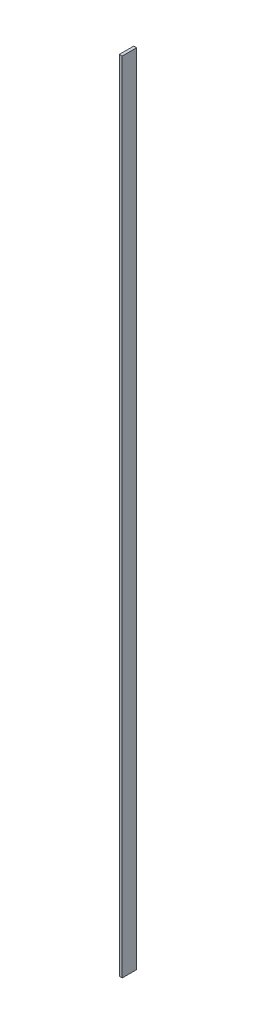
ISO-10303-21;
HEADER;
FILE_DESCRIPTION(('STEP AP214'),'2;1');
FILE_NAME('part.step','',(''),(''),'','','');
FILE_SCHEMA(('AUTOMOTIVE_DESIGN { 1 0 10303 214 1 1 1 1 }'));
ENDSEC;
DATA;
#1=APPLICATION_CONTEXT('core data for automotive mechanical design processes');
#2=APPLICATION_PROTOCOL_DEFINITION('international standard','automotive_design',2000,#1);
#3=PRODUCT_CONTEXT('',#1,'mechanical');
#4=PRODUCT('Part','Part','',(#3));
#5=PRODUCT_RELATED_PRODUCT_CATEGORY('part','',(#4));
#6=PRODUCT_DEFINITION_FORMATION('','',#4);
#7=PRODUCT_DEFINITION_CONTEXT('part definition',#1,'design');
#8=PRODUCT_DEFINITION('design','',#6,#7);
#9=PRODUCT_DEFINITION_SHAPE('','',#8);
#10=(LENGTH_UNIT() NAMED_UNIT(*) SI_UNIT(.MILLI.,.METRE.));
#11=(NAMED_UNIT(*) PLANE_ANGLE_UNIT() SI_UNIT($,.RADIAN.));
#12=(NAMED_UNIT(*) SI_UNIT($,.STERADIAN.) SOLID_ANGLE_UNIT());
#13=UNCERTAINTY_MEASURE_WITH_UNIT(LENGTH_MEASURE(1.E-05),#10,'distance_accuracy_value','');
#14=(GEOMETRIC_REPRESENTATION_CONTEXT(3) GLOBAL_UNCERTAINTY_ASSIGNED_CONTEXT((#13)) GLOBAL_UNIT_ASSIGNED_CONTEXT((#10,
#11,#12)) REPRESENTATION_CONTEXT('',''));
#15=CARTESIAN_POINT('',(0.,0.,0.));
#16=DIRECTION('',(0.,0.,1.));
#17=DIRECTION('',(1.,0.,0.));
#18=AXIS2_PLACEMENT_3D('',#15,#16,#17);
#19=CARTESIAN_POINT('',(2.,1100.,-10.));
#20=DIRECTION('',(-1.,0.,0.));
#21=DIRECTION('',(0.,0.,1.));
#22=AXIS2_PLACEMENT_3D('',#19,#20,#21);
#23=PLANE('',#22);
#24=DIRECTION('',(0.,0.,-1.));
#25=VECTOR('',#24,1.);
#26=CARTESIAN_POINT('',(2.,0.,-10.));
#27=LINE('',#26,#25);
#28=CARTESIAN_POINT('',(2.,0.,9.99999999999999));
#29=VERTEX_POINT('',#28);
#30=CARTESIAN_POINT('',(2.,0.,-10.));
#31=VERTEX_POINT('',#30);
#32=EDGE_CURVE('E97',#29,#31,#27,.T.);
#33=ORIENTED_EDGE('',*,*,#32,.T.);
#34=DIRECTION('',(0.,-1.,0.));
#35=VECTOR('',#34,1.);
#36=CARTESIAN_POINT('',(2.,1100.,-10.));
#37=LINE('',#36,#35);
#38=CARTESIAN_POINT('',(2.,1100.,-10.));
#39=VERTEX_POINT('',#38);
#40=EDGE_CURVE('E11',#39,#31,#37,.T.);
#41=ORIENTED_EDGE('',*,*,#40,.F.);
#42=DIRECTION('',(0.,0.,-1.));
#43=VECTOR('',#42,1.);
#44=CARTESIAN_POINT('',(2.,1100.,-10.));
#45=LINE('',#44,#43);
#46=CARTESIAN_POINT('',(2.,1100.,9.99999999999999));
#47=VERTEX_POINT('',#46);
#48=EDGE_CURVE('E85',#47,#39,#45,.T.);
#49=ORIENTED_EDGE('',*,*,#48,.F.);
#50=DIRECTION('',(0.,-1.,0.));
#51=VECTOR('',#50,1.);
#52=CARTESIAN_POINT('',(2.,1100.,9.99999999999999));
#53=LINE('',#52,#51);
#54=EDGE_CURVE('E93',#47,#29,#53,.T.);
#55=ORIENTED_EDGE('',*,*,#54,.T.);
#56=EDGE_LOOP('',(#33,#41,#49,#55));
#57=FACE_BOUND('',#56,.T.);
#58=ADVANCED_FACE('F34',(#57),#23,.F.);
#59=CARTESIAN_POINT('',(-2.,1100.,-10.));
#60=DIRECTION('',(0.,0.,1.));
#61=DIRECTION('',(1.,0.,0.));
#62=AXIS2_PLACEMENT_3D('',#59,#60,#61);
#63=PLANE('',#62);
#64=DIRECTION('',(-1.,0.,0.));
#65=VECTOR('',#64,1.);
#66=CARTESIAN_POINT('',(-2.,0.,-10.));
#67=LINE('',#66,#65);
#68=CARTESIAN_POINT('',(-2.,0.,-10.));
#69=VERTEX_POINT('',#68);
#70=EDGE_CURVE('E89',#31,#69,#67,.T.);
#71=ORIENTED_EDGE('',*,*,#70,.T.);
#72=DIRECTION('',(0.,-1.,0.));
#73=VECTOR('',#72,1.);
#74=CARTESIAN_POINT('',(-2.,1100.,-10.));
#75=LINE('',#74,#73);
#76=CARTESIAN_POINT('',(-2.,1100.,-10.));
#77=VERTEX_POINT('',#76);
#78=EDGE_CURVE('E42',#77,#69,#75,.T.);
#79=ORIENTED_EDGE('',*,*,#78,.F.);
#80=DIRECTION('',(-1.,0.,0.));
#81=VECTOR('',#80,1.);
#82=CARTESIAN_POINT('',(-2.,1100.,-10.));
#83=LINE('',#82,#81);
#84=EDGE_CURVE('E80',#39,#77,#83,.T.);
#85=ORIENTED_EDGE('',*,*,#84,.F.);
#86=ORIENTED_EDGE('',*,*,#40,.T.);
#87=EDGE_LOOP('',(#71,#79,#85,#86));
#88=FACE_BOUND('',#87,.T.);
#89=ADVANCED_FACE('F88',(#88),#63,.F.);
#90=CARTESIAN_POINT('',(-2.,1100.,-10.));
#91=DIRECTION('',(1.,0.,0.));
#92=DIRECTION('',(0.,0.,-1.));
#93=AXIS2_PLACEMENT_3D('',#90,#91,#92);
#94=PLANE('',#93);
#95=DIRECTION('',(0.,0.,1.));
#96=VECTOR('',#95,1.);
#97=CARTESIAN_POINT('',(-2.,0.,-10.));
#98=LINE('',#97,#96);
#99=CARTESIAN_POINT('',(-2.,0.,9.99999999999999));
#100=VERTEX_POINT('',#99);
#101=EDGE_CURVE('E67',#69,#100,#98,.T.);
#102=ORIENTED_EDGE('',*,*,#101,.T.);
#103=DIRECTION('',(0.,-1.,0.));
#104=VECTOR('',#103,1.);
#105=CARTESIAN_POINT('',(-2.,1100.,9.99999999999999));
#106=LINE('',#105,#104);
#107=CARTESIAN_POINT('',(-2.,1100.,9.99999999999999));
#108=VERTEX_POINT('',#107);
#109=EDGE_CURVE('E90',#108,#100,#106,.T.);
#110=ORIENTED_EDGE('',*,*,#109,.F.);
#111=DIRECTION('',(0.,0.,1.));
#112=VECTOR('',#111,1.);
#113=CARTESIAN_POINT('',(-2.,1100.,-10.));
#114=LINE('',#113,#112);
#115=EDGE_CURVE('E83',#77,#108,#114,.T.);
#116=ORIENTED_EDGE('',*,*,#115,.F.);
#117=ORIENTED_EDGE('',*,*,#78,.T.);
#118=EDGE_LOOP('',(#102,#110,#116,#117));
#119=FACE_BOUND('',#118,.T.);
#120=ADVANCED_FACE('F91',(#119),#94,.F.);
#121=CARTESIAN_POINT('',(-2.,1100.,9.99999999999999));
#122=DIRECTION('',(0.,0.,-1.));
#123=DIRECTION('',(-1.,0.,0.));
#124=AXIS2_PLACEMENT_3D('',#121,#122,#123);
#125=PLANE('',#124);
#126=DIRECTION('',(1.,0.,0.));
#127=VECTOR('',#126,1.);
#128=CARTESIAN_POINT('',(-2.,0.,9.99999999999999));
#129=LINE('',#128,#127);
#130=EDGE_CURVE('E73',#100,#29,#129,.T.);
#131=ORIENTED_EDGE('',*,*,#130,.T.);
#132=ORIENTED_EDGE('',*,*,#54,.F.);
#133=DIRECTION('',(1.,0.,0.));
#134=VECTOR('',#133,1.);
#135=CARTESIAN_POINT('',(-2.,1100.,9.99999999999999));
#136=LINE('',#135,#134);
#137=EDGE_CURVE('E50',#108,#47,#136,.T.);
#138=ORIENTED_EDGE('',*,*,#137,.F.);
#139=ORIENTED_EDGE('',*,*,#109,.T.);
#140=EDGE_LOOP('',(#131,#132,#138,#139));
#141=FACE_BOUND('',#140,.T.);
#142=ADVANCED_FACE('F104',(#141),#125,.F.);
#143=CARTESIAN_POINT('',(0.,1100.,0.));
#144=DIRECTION('',(0.,1.,0.));
#145=DIRECTION('',(0.,0.,1.));
#146=AXIS2_PLACEMENT_3D('',#143,#144,#145);
#147=PLANE('',#146);
#148=ORIENTED_EDGE('',*,*,#48,.T.);
#149=ORIENTED_EDGE('',*,*,#84,.T.);
#150=ORIENTED_EDGE('',*,*,#115,.T.);
#151=ORIENTED_EDGE('',*,*,#137,.T.);
#152=EDGE_LOOP('',(#148,#149,#150,#151));
#153=FACE_BOUND('',#152,.T.);
#154=ADVANCED_FACE('F81',(#153),#147,.T.);
#155=CARTESIAN_POINT('',(0.,0.,0.));
#156=DIRECTION('',(0.,1.,0.));
#157=DIRECTION('',(0.,0.,1.));
#158=AXIS2_PLACEMENT_3D('',#155,#156,#157);
#159=PLANE('',#158);
#160=ORIENTED_EDGE('',*,*,#32,.F.);
#161=ORIENTED_EDGE('',*,*,#130,.F.);
#162=ORIENTED_EDGE('',*,*,#101,.F.);
#163=ORIENTED_EDGE('',*,*,#70,.F.);
#164=EDGE_LOOP('',(#160,#161,#162,#163));
#165=FACE_BOUND('',#164,.T.);
#166=ADVANCED_FACE('F107',(#165),#159,.F.);
#167=CLOSED_SHELL('',(#58,#89,#120,#142,#154,#166));
#168=MANIFOLD_SOLID_BREP('B2',#167);
#169=ADVANCED_BREP_SHAPE_REPRESENTATION('',(#18,#168),#14);
#170=SHAPE_DEFINITION_REPRESENTATION(#9,#169);
ENDSEC;
END-ISO-10303-21;
